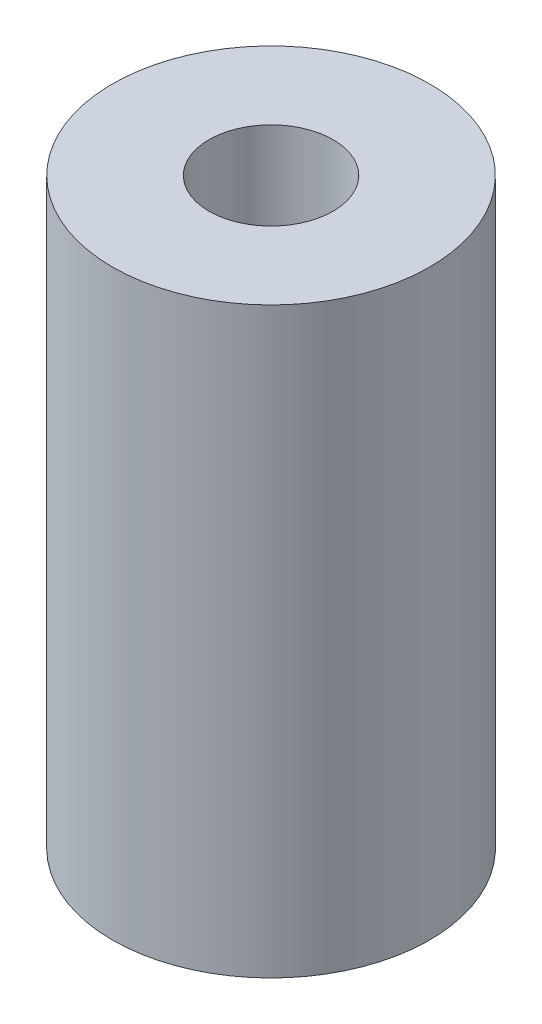
ISO-10303-21;
HEADER;
FILE_DESCRIPTION(('STEP AP214'),'2;1');
FILE_NAME('part.step','',(''),(''),'','','');
FILE_SCHEMA(('AUTOMOTIVE_DESIGN { 1 0 10303 214 1 1 1 1 }'));
ENDSEC;
DATA;
#1=APPLICATION_CONTEXT('core data for automotive mechanical design processes');
#2=APPLICATION_PROTOCOL_DEFINITION('international standard','automotive_design',2000,#1);
#3=PRODUCT_CONTEXT('',#1,'mechanical');
#4=PRODUCT('Part','Part','',(#3));
#5=PRODUCT_RELATED_PRODUCT_CATEGORY('part','',(#4));
#6=PRODUCT_DEFINITION_FORMATION('','',#4);
#7=PRODUCT_DEFINITION_CONTEXT('part definition',#1,'design');
#8=PRODUCT_DEFINITION('design','',#6,#7);
#9=PRODUCT_DEFINITION_SHAPE('','',#8);
#10=(LENGTH_UNIT() NAMED_UNIT(*) SI_UNIT(.MILLI.,.METRE.));
#11=(NAMED_UNIT(*) PLANE_ANGLE_UNIT() SI_UNIT($,.RADIAN.));
#12=(NAMED_UNIT(*) SI_UNIT($,.STERADIAN.) SOLID_ANGLE_UNIT());
#13=UNCERTAINTY_MEASURE_WITH_UNIT(LENGTH_MEASURE(1.E-05),#10,'distance_accuracy_value','');
#14=(GEOMETRIC_REPRESENTATION_CONTEXT(3) GLOBAL_UNCERTAINTY_ASSIGNED_CONTEXT((#13)) GLOBAL_UNIT_ASSIGNED_CONTEXT((#10,
#11,#12)) REPRESENTATION_CONTEXT('',''));
#15=CARTESIAN_POINT('',(0.,0.,0.));
#16=DIRECTION('',(0.,0.,1.));
#17=DIRECTION('',(1.,0.,0.));
#18=AXIS2_PLACEMENT_3D('',#15,#16,#17);
#19=CARTESIAN_POINT('',(0.,35.,0.));
#20=DIRECTION('',(0.,1.,0.));
#21=DIRECTION('',(0.,0.,1.));
#22=AXIS2_PLACEMENT_3D('',#19,#20,#21);
#23=PLANE('',#22);
#24=CARTESIAN_POINT('',(0.,35.,0.));
#25=DIRECTION('',(0.,1.,0.));
#26=DIRECTION('',(0.,0.,1.));
#27=AXIS2_PLACEMENT_3D('',#24,#25,#26);
#28=CIRCLE('',#27,9.525);
#29=CARTESIAN_POINT('',(0.,35.,9.525));
#30=VERTEX_POINT('',#29);
#31=EDGE_CURVE('E10',#30,#30,#28,.T.);
#32=ORIENTED_EDGE('',*,*,#31,.T.);
#33=EDGE_LOOP('',(#32));
#34=FACE_BOUND('',#33,.T.);
#35=CARTESIAN_POINT('',(0.,35.,0.));
#36=DIRECTION('',(0.,1.,0.));
#37=DIRECTION('',(0.,0.,1.));
#38=AXIS2_PLACEMENT_3D('',#35,#36,#37);
#39=CIRCLE('',#38,3.7258);
#40=CARTESIAN_POINT('',(0.,35.,3.7258));
#41=VERTEX_POINT('',#40);
#42=EDGE_CURVE('E48',#41,#41,#39,.T.);
#43=ORIENTED_EDGE('',*,*,#42,.F.);
#44=EDGE_LOOP('',(#43));
#45=FACE_BOUND('',#44,.T.);
#46=ADVANCED_FACE('F37',(#34,#45),#23,.T.);
#47=CARTESIAN_POINT('',(0.,0.,0.));
#48=DIRECTION('',(0.,1.,0.));
#49=DIRECTION('',(0.,0.,1.));
#50=AXIS2_PLACEMENT_3D('',#47,#48,#49);
#51=PLANE('',#50);
#52=CARTESIAN_POINT('',(0.,0.,0.));
#53=DIRECTION('',(0.,1.,0.));
#54=DIRECTION('',(0.,0.,1.));
#55=AXIS2_PLACEMENT_3D('',#52,#53,#54);
#56=CIRCLE('',#55,9.525);
#57=CARTESIAN_POINT('',(0.,0.,9.525));
#58=VERTEX_POINT('',#57);
#59=EDGE_CURVE('E41',#58,#58,#56,.T.);
#60=ORIENTED_EDGE('',*,*,#59,.F.);
#61=EDGE_LOOP('',(#60));
#62=FACE_BOUND('',#61,.T.);
#63=CARTESIAN_POINT('',(0.,0.,0.));
#64=DIRECTION('',(0.,1.,0.));
#65=DIRECTION('',(0.,0.,1.));
#66=AXIS2_PLACEMENT_3D('',#63,#64,#65);
#67=CIRCLE('',#66,3.7258);
#68=CARTESIAN_POINT('',(0.,0.,3.7258));
#69=VERTEX_POINT('',#68);
#70=EDGE_CURVE('E50',#69,#69,#67,.T.);
#71=ORIENTED_EDGE('',*,*,#70,.T.);
#72=EDGE_LOOP('',(#71));
#73=FACE_BOUND('',#72,.T.);
#74=ADVANCED_FACE('F60',(#62,#73),#51,.F.);
#75=CARTESIAN_POINT('',(0.,35.,0.));
#76=DIRECTION('',(0.,-1.,0.));
#77=DIRECTION('',(0.,0.,-1.));
#78=AXIS2_PLACEMENT_3D('',#75,#76,#77);
#79=CYLINDRICAL_SURFACE('',#78,9.525);
#80=ORIENTED_EDGE('',*,*,#31,.F.);
#81=EDGE_LOOP('',(#80));
#82=FACE_BOUND('',#81,.T.);
#83=ORIENTED_EDGE('',*,*,#59,.T.);
#84=EDGE_LOOP('',(#83));
#85=FACE_BOUND('',#84,.T.);
#86=ADVANCED_FACE('F39',(#82,#85),#79,.T.);
#87=CARTESIAN_POINT('',(0.,35.,0.));
#88=DIRECTION('',(0.,-1.,0.));
#89=DIRECTION('',(0.,0.,-1.));
#90=AXIS2_PLACEMENT_3D('',#87,#88,#89);
#91=CYLINDRICAL_SURFACE('',#90,3.7258);
#92=ORIENTED_EDGE('',*,*,#42,.T.);
#93=EDGE_LOOP('',(#92));
#94=FACE_BOUND('',#93,.T.);
#95=ORIENTED_EDGE('',*,*,#70,.F.);
#96=EDGE_LOOP('',(#95));
#97=FACE_BOUND('',#96,.T.);
#98=ADVANCED_FACE('F56',(#94,#97),#91,.F.);
#99=CLOSED_SHELL('',(#46,#74,#86,#98));
#100=MANIFOLD_SOLID_BREP('B2',#99);
#101=ADVANCED_BREP_SHAPE_REPRESENTATION('',(#18,#100),#14);
#102=SHAPE_DEFINITION_REPRESENTATION(#9,#101);
ENDSEC;
END-ISO-10303-21;
